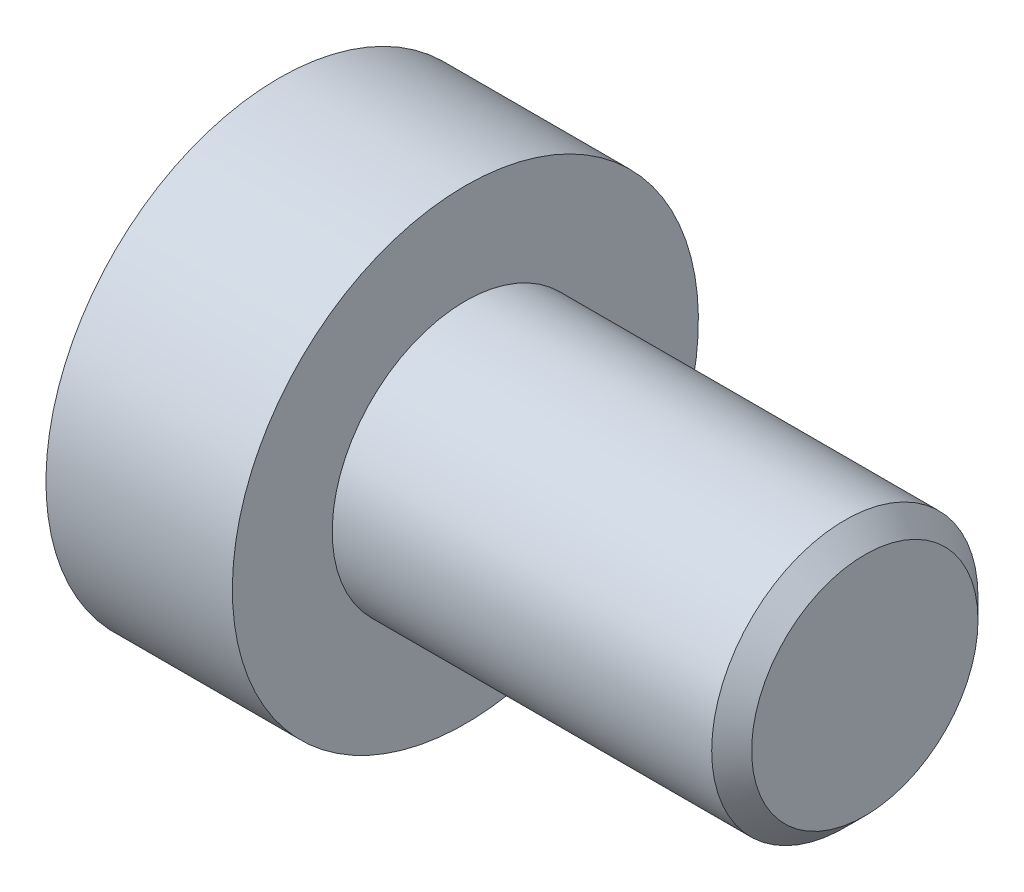
ISO-10303-21;
HEADER;
FILE_DESCRIPTION(('STEP AP214'),'2;1');
FILE_NAME('part.step','',(''),(''),'','','');
FILE_SCHEMA(('AUTOMOTIVE_DESIGN { 1 0 10303 214 1 1 1 1 }'));
ENDSEC;
DATA;
#1=APPLICATION_CONTEXT('core data for automotive mechanical design processes');
#2=APPLICATION_PROTOCOL_DEFINITION('international standard','automotive_design',2000,#1);
#3=PRODUCT_CONTEXT('',#1,'mechanical');
#4=PRODUCT('Part','Part','',(#3));
#5=PRODUCT_RELATED_PRODUCT_CATEGORY('part','',(#4));
#6=PRODUCT_DEFINITION_FORMATION('','',#4);
#7=PRODUCT_DEFINITION_CONTEXT('part definition',#1,'design');
#8=PRODUCT_DEFINITION('design','',#6,#7);
#9=PRODUCT_DEFINITION_SHAPE('','',#8);
#10=(LENGTH_UNIT() NAMED_UNIT(*) SI_UNIT(.MILLI.,.METRE.));
#11=(NAMED_UNIT(*) PLANE_ANGLE_UNIT() SI_UNIT($,.RADIAN.));
#12=(NAMED_UNIT(*) SI_UNIT($,.STERADIAN.) SOLID_ANGLE_UNIT());
#13=UNCERTAINTY_MEASURE_WITH_UNIT(LENGTH_MEASURE(1.E-05),#10,'distance_accuracy_value','');
#14=(GEOMETRIC_REPRESENTATION_CONTEXT(3) GLOBAL_UNCERTAINTY_ASSIGNED_CONTEXT((#13)) GLOBAL_UNIT_ASSIGNED_CONTEXT((#10,
#11,#12)) REPRESENTATION_CONTEXT('',''));
#15=CARTESIAN_POINT('',(0.,0.,0.));
#16=DIRECTION('',(0.,0.,1.));
#17=DIRECTION('',(1.,0.,0.));
#18=AXIS2_PLACEMENT_3D('',#15,#16,#17);
#19=CARTESIAN_POINT('',(-6.,0.,0.));
#20=DIRECTION('',(1.,0.,0.));
#21=DIRECTION('',(0.,0.,-1.));
#22=AXIS2_PLACEMENT_3D('',#19,#20,#21);
#23=CYLINDRICAL_SURFACE('',#22,2.);
#24=CARTESIAN_POINT('',(-0.300000000000003,0.,0.));
#25=DIRECTION('',(1.,0.,0.));
#26=DIRECTION('',(0.,0.,-1.));
#27=AXIS2_PLACEMENT_3D('',#24,#25,#26);
#28=CIRCLE('',#27,2.);
#29=CARTESIAN_POINT('',(-0.300000000000003,0.,-2.));
#30=VERTEX_POINT('',#29);
#31=EDGE_CURVE('E50',#30,#30,#28,.F.);
#32=ORIENTED_EDGE('',*,*,#31,.T.);
#33=EDGE_LOOP('',(#32));
#34=FACE_BOUND('',#33,.T.);
#35=CARTESIAN_POINT('',(-6.,0.,0.));
#36=DIRECTION('',(1.,0.,0.));
#37=DIRECTION('',(0.,1.,0.));
#38=AXIS2_PLACEMENT_3D('',#35,#36,#37);
#39=CIRCLE('',#38,2.);
#40=CARTESIAN_POINT('',(-6.,1.99999999999999,0.));
#41=VERTEX_POINT('',#40);
#42=EDGE_CURVE('E126',#41,#41,#39,.F.);
#43=ORIENTED_EDGE('',*,*,#42,.F.);
#44=EDGE_LOOP('',(#43));
#45=FACE_BOUND('',#44,.T.);
#46=ADVANCED_FACE('F36',(#34,#45),#23,.T.);
#47=CARTESIAN_POINT('',(0.,0.,0.));
#48=DIRECTION('',(1.,0.,0.));
#49=DIRECTION('',(0.,0.,-1.));
#50=AXIS2_PLACEMENT_3D('',#47,#48,#49);
#51=PLANE('',#50);
#52=CARTESIAN_POINT('',(0.,0.,0.));
#53=DIRECTION('',(1.,0.,0.));
#54=DIRECTION('',(0.,0.,-1.));
#55=AXIS2_PLACEMENT_3D('',#52,#53,#54);
#56=CIRCLE('',#55,1.7);
#57=CARTESIAN_POINT('',(0.,0.,-1.7));
#58=VERTEX_POINT('',#57);
#59=EDGE_CURVE('E129',#58,#58,#56,.T.);
#60=ORIENTED_EDGE('',*,*,#59,.T.);
#61=EDGE_LOOP('',(#60));
#62=FACE_BOUND('',#61,.T.);
#63=ADVANCED_FACE('F139',(#62),#51,.T.);
#64=CARTESIAN_POINT('',(0.,0.,0.));
#65=DIRECTION('',(-1.,0.,0.));
#66=DIRECTION('',(0.,0.,1.));
#67=AXIS2_PLACEMENT_3D('',#64,#65,#66);
#68=CONICAL_SURFACE('',#67,1.7,0.785398163397444);
#69=ORIENTED_EDGE('',*,*,#31,.F.);
#70=EDGE_LOOP('',(#69));
#71=FACE_BOUND('',#70,.T.);
#72=ORIENTED_EDGE('',*,*,#59,.F.);
#73=EDGE_LOOP('',(#72));
#74=FACE_BOUND('',#73,.T.);
#75=ADVANCED_FACE('F38',(#71,#74),#68,.T.);
#76=CARTESIAN_POINT('',(-8.8,0.,0.));
#77=DIRECTION('',(-1.,0.,0.));
#78=DIRECTION('',(0.,-1.,0.));
#79=AXIS2_PLACEMENT_3D('',#76,#77,#78);
#80=PLANE('',#79);
#81=CARTESIAN_POINT('',(-8.8,0.,0.));
#82=DIRECTION('',(-1.,0.,0.));
#83=DIRECTION('',(0.,-1.,0.));
#84=AXIS2_PLACEMENT_3D('',#81,#82,#83);
#85=CIRCLE('',#84,1.49337567297408);
#86=CARTESIAN_POINT('',(-8.80000000000001,-1.49337567297405,0.));
#87=VERTEX_POINT('',#86);
#88=EDGE_CURVE('E244',#87,#87,#85,.T.);
#89=ORIENTED_EDGE('',*,*,#88,.F.);
#90=EDGE_LOOP('',(#89));
#91=FACE_BOUND('',#90,.T.);
#92=CARTESIAN_POINT('',(-8.8,0.,0.));
#93=DIRECTION('',(1.,0.,0.));
#94=DIRECTION('',(0.,1.,0.));
#95=AXIS2_PLACEMENT_3D('',#92,#93,#94);
#96=CIRCLE('',#95,3.5);
#97=CARTESIAN_POINT('',(-8.8,3.5,0.));
#98=VERTEX_POINT('',#97);
#99=EDGE_CURVE('E123',#98,#98,#96,.T.);
#100=ORIENTED_EDGE('',*,*,#99,.F.);
#101=EDGE_LOOP('',(#100));
#102=FACE_BOUND('',#101,.T.);
#103=ADVANCED_FACE('F138',(#91,#102),#80,.T.);
#104=CARTESIAN_POINT('',(-6.,0.,0.));
#105=DIRECTION('',(1.,0.,0.));
#106=DIRECTION('',(0.,1.,0.));
#107=AXIS2_PLACEMENT_3D('',#104,#105,#106);
#108=CYLINDRICAL_SURFACE('',#107,3.5);
#109=ORIENTED_EDGE('',*,*,#99,.T.);
#110=EDGE_LOOP('',(#109));
#111=FACE_BOUND('',#110,.T.);
#112=CARTESIAN_POINT('',(-6.,0.,0.));
#113=DIRECTION('',(1.,0.,0.));
#114=DIRECTION('',(0.,1.,0.));
#115=AXIS2_PLACEMENT_3D('',#112,#113,#114);
#116=CIRCLE('',#115,3.5);
#117=CARTESIAN_POINT('',(-6.,3.5,0.));
#118=VERTEX_POINT('',#117);
#119=EDGE_CURVE('E120',#118,#118,#116,.T.);
#120=ORIENTED_EDGE('',*,*,#119,.F.);
#121=EDGE_LOOP('',(#120));
#122=FACE_BOUND('',#121,.T.);
#123=ADVANCED_FACE('F150',(#111,#122),#108,.T.);
#124=CARTESIAN_POINT('',(-6.,3.5,0.));
#125=DIRECTION('',(1.,0.,0.));
#126=DIRECTION('',(0.,1.,0.));
#127=AXIS2_PLACEMENT_3D('',#124,#125,#126);
#128=PLANE('',#127);
#129=ORIENTED_EDGE('',*,*,#42,.T.);
#130=EDGE_LOOP('',(#129));
#131=FACE_BOUND('',#130,.T.);
#132=ORIENTED_EDGE('',*,*,#119,.T.);
#133=EDGE_LOOP('',(#132));
#134=FACE_BOUND('',#133,.T.);
#135=ADVANCED_FACE('F154',(#131,#134),#128,.T.);
#136=CARTESIAN_POINT('',(-8.8,0.,0.));
#137=DIRECTION('',(-1.,0.,0.));
#138=DIRECTION('',(0.,-1.,0.));
#139=AXIS2_PLACEMENT_3D('',#136,#137,#138);
#140=CONICAL_SURFACE('',#139,1.49337567297408,0.78539816339745);
#141=ORIENTED_EDGE('',*,*,#88,.T.);
#142=EDGE_LOOP('',(#141));
#143=FACE_BOUND('',#142,.T.);
#144=CARTESIAN_POINT('',(-9.20140216898837,-1.42396736984798,1.25));
#145=CARTESIAN_POINT('',(-9.17529613644805,-1.38922450814775,1.25));
#146=CARTESIAN_POINT('',(-9.14945065634314,-1.35428640192996,1.25));
#147=CARTESIAN_POINT('',(-9.09838791202342,-1.28394100441963,1.25));
#148=CARTESIAN_POINT('',(-9.07317080935882,-1.24853359598577,1.25));
#149=CARTESIAN_POINT('',(-8.99826335395112,-1.1409714001612,1.25));
#150=CARTESIAN_POINT('',(-8.94971904359717,-1.0680049582675,1.25));
#151=CARTESIAN_POINT('',(-8.85456001629848,-0.915095472420351,1.25));
#152=CARTESIAN_POINT('',(-8.80820303826042,-0.834990154954495,1.25));
#153=CARTESIAN_POINT('',(-8.72350392700248,-0.670798348959412,1.25));
#154=CARTESIAN_POINT('',(-8.68513479787227,-0.58672648793716,1.25));
#155=CARTESIAN_POINT('',(-8.63819850204759,-0.460385334768697,1.25));
#156=CARTESIAN_POINT('',(-8.62470212076981,-0.419954113336603,1.25));
#157=CARTESIAN_POINT('',(-8.60095730744747,-0.338129031291281,1.25));
#158=CARTESIAN_POINT('',(-8.5907091035293,-0.296735103284174,1.25));
#159=CARTESIAN_POINT('',(-8.57415946635525,-0.213916243687788,1.25));
#160=CARTESIAN_POINT('',(-8.56779133855251,-0.172504848949336,1.25));
#161=CARTESIAN_POINT('',(-8.55912371966082,-0.0892560954741928,1.25));
#162=CARTESIAN_POINT('',(-8.55682355999816,-0.0474188078703005,1.25));
#163=CARTESIAN_POINT('',(-8.55645641051935,0.0348235296905066,1.25));
#164=CARTESIAN_POINT('',(-8.55824554854156,0.0752279922916836,1.25));
#165=CARTESIAN_POINT('',(-8.56564480351348,0.155687005579612,1.25));
#166=CARTESIAN_POINT('',(-8.57125566297007,0.195741486737967,1.25));
#167=CARTESIAN_POINT('',(-8.5860898151071,0.275882483894674,1.25));
#168=CARTESIAN_POINT('',(-8.59537388954039,0.315957579678778,1.25));
#169=CARTESIAN_POINT('',(-8.61706569649922,0.395234027395286,1.25));
#170=CARTESIAN_POINT('',(-8.62947314897842,0.434435457318926,1.25));
#171=CARTESIAN_POINT('',(-8.6734108304631,0.558570325397125,1.25));
#172=CARTESIAN_POINT('',(-8.70997441432895,0.641718054005946,1.25));
#173=CARTESIAN_POINT('',(-8.79124788730661,0.804100725662088,1.25));
#174=CARTESIAN_POINT('',(-8.83598718952972,0.883320183915878,1.25));
#175=CARTESIAN_POINT('',(-8.92826522864606,1.03470895505823,1.25));
#176=CARTESIAN_POINT('',(-8.97555343888178,1.10703287925038,1.25));
#177=CARTESIAN_POINT('',(-9.04864632092525,1.21358798649191,1.25));
#178=CARTESIAN_POINT('',(-9.07326644329957,1.24864609054882,1.25));
#179=CARTESIAN_POINT('',(-9.12315526013102,1.31828380805649,1.25));
#180=CARTESIAN_POINT('',(-9.14842377580172,1.35286354944694,1.25));
#181=CARTESIAN_POINT('',(-9.17396105811685,1.38724419886388,1.25));
#182=B_SPLINE_CURVE_WITH_KNOTS('',3,(#144,#145,#146,#147,#148,#149,#150,#151,#152,#153,#154,
#155,#156,#157,#158,#159,#160,#161,#162,#163,#164,#165,#166,#167,#168,#169,#170,#171,#172,#173,
#174,#175,#176,#177,#178,#179,#180,#181),.UNSPECIFIED.,.F.,.F.,(4,2,2,2,2,2,2,2,2,2,2,2,2,2,2,2,
2,2,4),(0.,0.130370422461748,0.260774023229279,0.523571931962181,0.800995227642792,
1.07746514553942,1.20522972687283,1.33300327939672,1.45851355132216,1.5840031936199,
1.70514602294322,1.82631239533597,1.94957373840992,2.07282403363807,2.34451838945522,
2.61721016161585,2.87631588769062,3.00482945023601,3.13330794967362),.UNSPECIFIED.);
#183=CARTESIAN_POINT('',(-8.74999999999999,-0.721687836486998,1.25));
#184=VERTEX_POINT('',#183);
#185=CARTESIAN_POINT('',(-8.74999999999998,0.721687836487067,1.25));
#186=VERTEX_POINT('',#185);
#187=EDGE_CURVE('E104',#184,#186,#182,.T.);
#188=ORIENTED_EDGE('',*,*,#187,.F.);
#189=CARTESIAN_POINT('',(-8.75011548390912,-1.44349114302787,-0.000200000000000523));
#190=CARTESIAN_POINT('',(-8.72532166805509,-1.41867941875062,0.0427751670715866));
#191=CARTESIAN_POINT('',(-8.70198373441867,-1.3934527698074,0.086469004745948));
#192=CARTESIAN_POINT('',(-8.65925200408452,-1.34201263554191,0.175565930841942));
#193=CARTESIAN_POINT('',(-8.6398819923604,-1.31579425481273,0.220977498357063));
#194=CARTESIAN_POINT('',(-8.60670048341346,-1.26292610442243,0.312547820935259));
#195=CARTESIAN_POINT('',(-8.59280555905264,-1.23628980770468,0.358683240175885));
#196=CARTESIAN_POINT('',(-8.57139728216062,-1.18243062538505,0.451970080407591));
#197=CARTESIAN_POINT('',(-8.56386794156677,-1.15520938653758,0.499118649136379));
#198=CARTESIAN_POINT('',(-8.55707449805069,-1.10829684367464,0.580373556887251));
#199=CARTESIAN_POINT('',(-8.55606855910434,-1.08866617256955,0.61437487662794));
#200=CARTESIAN_POINT('',(-8.55776141491131,-1.04943932800608,0.682317764432476));
#201=CARTESIAN_POINT('',(-8.56046102721552,-1.02984316311596,0.716259317655657));
#202=CARTESIAN_POINT('',(-8.56940893031636,-0.990839954603466,0.783814856457499));
#203=CARTESIAN_POINT('',(-8.57566052589969,-0.971433104248738,0.817428507286774));
#204=CARTESIAN_POINT('',(-8.59137568141389,-0.932943395609872,0.884094638217812));
#205=CARTESIAN_POINT('',(-8.60084062008744,-0.913860680098267,0.917146871030295));
#206=CARTESIAN_POINT('',(-8.62893139068757,-0.864986351354534,1.00179969160026));
#207=CARTESIAN_POINT('',(-8.64967015745219,-0.835502920149042,1.05286649242964));
#208=CARTESIAN_POINT('',(-8.69638713467146,-0.777690319475875,1.15300085411325));
#209=CARTESIAN_POINT('',(-8.72234829594675,-0.749357745598383,1.20207431157827));
#210=CARTESIAN_POINT('',(-8.75011548390912,-0.72157236643316,1.2502));
#211=B_SPLINE_CURVE_WITH_KNOTS('',3,(#189,#190,#191,#192,#193,#194,#195,#196,#197,#198,#199,
#200,#201,#202,#203,#204,#205,#206,#207,#208,#209,#210),.UNSPECIFIED.,.F.,.F.,(4,2,2,2,2,2,2,2,
2,2,4),(0.,0.166533409618304,0.334037607289761,0.498880396489698,0.663307919240274,
0.780963963458826,0.898645970148452,1.01643764860773,1.13427993171549,1.32148652032141,
1.50809158792573),.UNSPECIFIED.);
#212=CARTESIAN_POINT('',(-8.74999999999999,-1.44337567297403,0.));
#213=VERTEX_POINT('',#212);
#214=EDGE_CURVE('E200',#213,#184,#211,.T.);
#215=ORIENTED_EDGE('',*,*,#214,.F.);
#216=CARTESIAN_POINT('',(-8.75011548390912,-0.72157236643316,-1.2502));
#217=CARTESIAN_POINT('',(-8.72532166805509,-0.74638409071041,-1.20722483292841));
#218=CARTESIAN_POINT('',(-8.70198373441867,-0.77161073965363,-1.16353099525405));
#219=CARTESIAN_POINT('',(-8.65925200408452,-0.82305087391912,-1.07443406915806));
#220=CARTESIAN_POINT('',(-8.6398819923604,-0.849269254648299,-1.02902250164294));
#221=CARTESIAN_POINT('',(-8.60670048341346,-0.902137405038601,-0.937452179064741));
#222=CARTESIAN_POINT('',(-8.59280555905264,-0.928773701756353,-0.891316759824115));
#223=CARTESIAN_POINT('',(-8.57139728216062,-0.982632884075978,-0.798029919592408));
#224=CARTESIAN_POINT('',(-8.56386794156677,-1.00985412292345,-0.750881350863621));
#225=CARTESIAN_POINT('',(-8.55707449805069,-1.05676666578639,-0.669626443112748));
#226=CARTESIAN_POINT('',(-8.55606855910434,-1.07639733689148,-0.63562512337206));
#227=CARTESIAN_POINT('',(-8.55776141491131,-1.11562418145495,-0.567682235567523));
#228=CARTESIAN_POINT('',(-8.56046102721552,-1.13522034634507,-0.533740682344343));
#229=CARTESIAN_POINT('',(-8.56940893031636,-1.17422355485756,-0.466185143542501));
#230=CARTESIAN_POINT('',(-8.57566052589969,-1.19363040521229,-0.432571492713226));
#231=CARTESIAN_POINT('',(-8.59137568141389,-1.23212011385116,-0.365905361782188));
#232=CARTESIAN_POINT('',(-8.60084062008744,-1.25120282936276,-0.332853128969705));
#233=CARTESIAN_POINT('',(-8.62893139068757,-1.30007715810649,-0.248200308399737));
#234=CARTESIAN_POINT('',(-8.64967015745219,-1.32956058931199,-0.197133507570363));
#235=CARTESIAN_POINT('',(-8.69638713467146,-1.38737318998515,-0.0969991458867464));
#236=CARTESIAN_POINT('',(-8.72234829594676,-1.41570576386264,-0.0479256884217317));
#237=CARTESIAN_POINT('',(-8.75011548390912,-1.44349114302787,0.000199999999999044));
#238=B_SPLINE_CURVE_WITH_KNOTS('',3,(#216,#217,#218,#219,#220,#221,#222,#223,#224,#225,#226,
#227,#228,#229,#230,#231,#232,#233,#234,#235,#236,#237),.UNSPECIFIED.,.F.,.F.,(4,2,2,2,2,2,2,2,
2,2,4),(0.,0.166533409618303,0.334037607289761,0.498880396489697,0.663307919240273,
0.780963963458825,0.898645970148451,1.01643764860773,1.13427993171549,1.32148652032141,
1.50809158792573),.UNSPECIFIED.);
#239=CARTESIAN_POINT('',(-8.74999999999999,-0.721687836486998,-1.25));
#240=VERTEX_POINT('',#239);
#241=EDGE_CURVE('E194',#240,#213,#238,.T.);
#242=ORIENTED_EDGE('',*,*,#241,.F.);
#243=CARTESIAN_POINT('',(-9.20140216898837,-1.42396736984798,-1.25));
#244=CARTESIAN_POINT('',(-9.17529613644804,-1.38922450814774,-1.25));
#245=CARTESIAN_POINT('',(-9.14945065634314,-1.35428640192996,-1.25));
#246=CARTESIAN_POINT('',(-9.09838791202342,-1.28394100441962,-1.25));
#247=CARTESIAN_POINT('',(-9.07317080935881,-1.24853359598576,-1.25));
#248=CARTESIAN_POINT('',(-8.99826335395112,-1.14097140016119,-1.25));
#249=CARTESIAN_POINT('',(-8.94971904359717,-1.0680049582675,-1.25));
#250=CARTESIAN_POINT('',(-8.85456001629848,-0.91509547242035,-1.25));
#251=CARTESIAN_POINT('',(-8.80820303826042,-0.834990154954493,-1.25));
#252=CARTESIAN_POINT('',(-8.72350392700248,-0.670798348959409,-1.25));
#253=CARTESIAN_POINT('',(-8.68513479787227,-0.586726487937158,-1.25));
#254=CARTESIAN_POINT('',(-8.63819850204759,-0.460385334768696,-1.25));
#255=CARTESIAN_POINT('',(-8.62470212076981,-0.419954113336601,-1.25));
#256=CARTESIAN_POINT('',(-8.60095730744747,-0.33812903129128,-1.25));
#257=CARTESIAN_POINT('',(-8.5907091035293,-0.296735103284173,-1.25));
#258=CARTESIAN_POINT('',(-8.57415946635525,-0.213916243687787,-1.25));
#259=CARTESIAN_POINT('',(-8.56779133855251,-0.172504848949335,-1.25));
#260=CARTESIAN_POINT('',(-8.55912371966082,-0.0892560954741923,-1.25));
#261=CARTESIAN_POINT('',(-8.55682355999816,-0.0474188078703002,-1.25));
#262=CARTESIAN_POINT('',(-8.55645641051935,0.0348235296905068,-1.25));
#263=CARTESIAN_POINT('',(-8.55824554854156,0.0752279922916837,-1.25));
#264=CARTESIAN_POINT('',(-8.56564480351348,0.155687005579612,-1.25));
#265=CARTESIAN_POINT('',(-8.57125566297007,0.195741486737967,-1.25));
#266=CARTESIAN_POINT('',(-8.5860898151071,0.275882483894674,-1.25));
#267=CARTESIAN_POINT('',(-8.59537388954039,0.315957579678778,-1.25));
#268=CARTESIAN_POINT('',(-8.61706569649922,0.395234027395286,-1.25));
#269=CARTESIAN_POINT('',(-8.62947314897842,0.434435457318926,-1.25));
#270=CARTESIAN_POINT('',(-8.6734108304631,0.558570325397125,-1.25));
#271=CARTESIAN_POINT('',(-8.70997441432895,0.641718054005946,-1.25));
#272=CARTESIAN_POINT('',(-8.79124788730661,0.804100725662087,-1.25));
#273=CARTESIAN_POINT('',(-8.83598718952972,0.883320183915878,-1.25));
#274=CARTESIAN_POINT('',(-8.92826522864606,1.03470895505823,-1.25));
#275=CARTESIAN_POINT('',(-8.97555343888178,1.10703287925038,-1.25));
#276=CARTESIAN_POINT('',(-9.04864632092525,1.21358798649191,-1.25));
#277=CARTESIAN_POINT('',(-9.07326644329957,1.24864609054882,-1.25));
#278=CARTESIAN_POINT('',(-9.12315526013102,1.31828380805649,-1.25));
#279=CARTESIAN_POINT('',(-9.14842377580172,1.35286354944694,-1.25));
#280=CARTESIAN_POINT('',(-9.17396105811685,1.38724419886388,-1.25));
#281=B_SPLINE_CURVE_WITH_KNOTS('',3,(#243,#244,#245,#246,#247,#248,#249,#250,#251,#252,#253,
#254,#255,#256,#257,#258,#259,#260,#261,#262,#263,#264,#265,#266,#267,#268,#269,#270,#271,#272,
#273,#274,#275,#276,#277,#278,#279,#280),.UNSPECIFIED.,.F.,.F.,(4,2,2,2,2,2,2,2,2,2,2,2,2,2,2,2,
2,2,4),(0.,0.130370422461749,0.26077402322928,0.523571931962181,0.800995227642793,
1.07746514553942,1.20522972687283,1.33300327939672,1.45851355132216,1.5840031936199,
1.70514602294322,1.82631239533597,1.94957373840992,2.07282403363807,2.34451838945522,
2.61721016161585,2.87631588769062,3.004829450236,3.13330794967362),.UNSPECIFIED.);
#282=CARTESIAN_POINT('',(-8.74999999999998,0.721687836487067,-1.25));
#283=VERTEX_POINT('',#282);
#284=EDGE_CURVE('E57',#283,#240,#281,.F.);
#285=ORIENTED_EDGE('',*,*,#284,.F.);
#286=CARTESIAN_POINT('',(-8.75011548390911,1.44349114302794,0.000200000000000746));
#287=CARTESIAN_POINT('',(-8.72532166805508,1.41867941875069,-0.0427751670715857));
#288=CARTESIAN_POINT('',(-8.70198373441866,1.39345276980747,-0.0864690047459471));
#289=CARTESIAN_POINT('',(-8.65925200408451,1.34201263554198,-0.175565930841941));
#290=CARTESIAN_POINT('',(-8.63988199236039,1.3157942548128,-0.220977498357063));
#291=CARTESIAN_POINT('',(-8.60670048341346,1.26292610442249,-0.312547820935259));
#292=CARTESIAN_POINT('',(-8.59280555905263,1.23628980770474,-0.358683240175885));
#293=CARTESIAN_POINT('',(-8.57139728216062,1.18243062538512,-0.451970080407592));
#294=CARTESIAN_POINT('',(-8.56386794156676,1.15520938653765,-0.499118649136379));
#295=CARTESIAN_POINT('',(-8.55707449805068,1.1082968436747,-0.580373556887252));
#296=CARTESIAN_POINT('',(-8.55606855910433,1.08866617256961,-0.61437487662794));
#297=CARTESIAN_POINT('',(-8.5577614149113,1.04943932800614,-0.682317764432477));
#298=CARTESIAN_POINT('',(-8.56046102721552,1.02984316311603,-0.716259317655657));
#299=CARTESIAN_POINT('',(-8.56940893031636,0.990839954603533,-0.783814856457499));
#300=CARTESIAN_POINT('',(-8.57566052589968,0.971433104248805,-0.817428507286774));
#301=CARTESIAN_POINT('',(-8.59137568141388,0.932943395609939,-0.884094638217812));
#302=CARTESIAN_POINT('',(-8.60084062008744,0.913860680098334,-0.917146871030295));
#303=CARTESIAN_POINT('',(-8.62893139068757,0.864986351354602,-1.00179969160026));
#304=CARTESIAN_POINT('',(-8.64967015745218,0.83550292014911,-1.05286649242964));
#305=CARTESIAN_POINT('',(-8.69638713467145,0.777690319475943,-1.15300085411325));
#306=CARTESIAN_POINT('',(-8.72234829594674,0.749357745598451,-1.20207431157827));
#307=CARTESIAN_POINT('',(-8.75011548390911,0.721572366433229,-1.2502));
#308=B_SPLINE_CURVE_WITH_KNOTS('',3,(#286,#287,#288,#289,#290,#291,#292,#293,#294,#295,#296,
#297,#298,#299,#300,#301,#302,#303,#304,#305,#306,#307),.UNSPECIFIED.,.F.,.F.,(4,2,2,2,2,2,2,2,
2,2,4),(0.,0.166533409618304,0.334037607289762,0.498880396489699,0.663307919240275,
0.780963963458827,0.898645970148453,1.01643764860773,1.1342799317155,1.32148652032141,
1.50809158792574),.UNSPECIFIED.);
#309=CARTESIAN_POINT('',(-8.74999999999998,1.4433756729741,0.));
#310=VERTEX_POINT('',#309);
#311=EDGE_CURVE('E11',#310,#283,#308,.T.);
#312=ORIENTED_EDGE('',*,*,#311,.F.);
#313=CARTESIAN_POINT('',(-8.75011548390911,0.721572366433229,1.2502));
#314=CARTESIAN_POINT('',(-8.72532166805508,0.746384090710478,1.20722483292841));
#315=CARTESIAN_POINT('',(-8.70198373441866,0.771610739653699,1.16353099525405));
#316=CARTESIAN_POINT('',(-8.65925200408452,0.823050873919189,1.07443406915806));
#317=CARTESIAN_POINT('',(-8.63988199236039,0.849269254648367,1.02902250164294));
#318=CARTESIAN_POINT('',(-8.60670048341346,0.902137405038669,0.93745217906474));
#319=CARTESIAN_POINT('',(-8.59280555905263,0.92877370175642,0.891316759824115));
#320=CARTESIAN_POINT('',(-8.57139728216062,0.982632884076045,0.798029919592408));
#321=CARTESIAN_POINT('',(-8.56386794156676,1.00985412292352,0.750881350863621));
#322=CARTESIAN_POINT('',(-8.55707449805068,1.05676666578646,0.669626443112749));
#323=CARTESIAN_POINT('',(-8.55606855910433,1.07639733689155,0.63562512337206));
#324=CARTESIAN_POINT('',(-8.5577614149113,1.11562418145502,0.567682235567524));
#325=CARTESIAN_POINT('',(-8.56046102721552,1.13522034634514,0.533740682344343));
#326=CARTESIAN_POINT('',(-8.56940893031635,1.17422355485763,0.466185143542501));
#327=CARTESIAN_POINT('',(-8.57566052589968,1.19363040521236,0.432571492713226));
#328=CARTESIAN_POINT('',(-8.59137568141388,1.23212011385122,0.365905361782188));
#329=CARTESIAN_POINT('',(-8.60084062008744,1.25120282936283,0.332853128969706));
#330=CARTESIAN_POINT('',(-8.62893139068756,1.30007715810656,0.248200308399737));
#331=CARTESIAN_POINT('',(-8.64967015745218,1.32956058931205,0.197133507570363));
#332=CARTESIAN_POINT('',(-8.69638713467145,1.38737318998522,0.0969991458867466));
#333=CARTESIAN_POINT('',(-8.72234829594674,1.41570576386271,0.0479256884217319));
#334=CARTESIAN_POINT('',(-8.75011548390911,1.44349114302794,-0.000199999999998879));
#335=B_SPLINE_CURVE_WITH_KNOTS('',3,(#313,#314,#315,#316,#317,#318,#319,#320,#321,#322,#323,
#324,#325,#326,#327,#328,#329,#330,#331,#332,#333,#334),.UNSPECIFIED.,.F.,.F.,(4,2,2,2,2,2,2,2,
2,2,4),(0.,0.166533409618303,0.334037607289761,0.498880396489696,0.663307919240272,
0.780963963458825,0.898645970148451,1.01643764860773,1.13427993171549,1.32148652032141,
1.50809158792573),.UNSPECIFIED.);
#336=EDGE_CURVE('E95',#186,#310,#335,.T.);
#337=ORIENTED_EDGE('',*,*,#336,.F.);
#338=EDGE_LOOP('',(#188,#215,#242,#285,#312,#337));
#339=FACE_BOUND('',#338,.T.);
#340=ADVANCED_FACE('F94',(#143,#339),#140,.F.);
#341=CARTESIAN_POINT('',(-7.2,0.,0.));
#342=DIRECTION('',(-1.,0.,0.));
#343=DIRECTION('',(0.,-1.,0.));
#344=AXIS2_PLACEMENT_3D('',#341,#342,#343);
#345=PLANE('',#344);
#346=DIRECTION('',(0.,0.5,-0.866025403784439));
#347=VECTOR('',#346,1.);
#348=CARTESIAN_POINT('',(-7.2,0.721687836487061,1.25));
#349=LINE('',#348,#347);
#350=CARTESIAN_POINT('',(-7.2,0.721687836487061,1.25));
#351=VERTEX_POINT('',#350);
#352=CARTESIAN_POINT('',(-7.2,1.44337567297409,0.));
#353=VERTEX_POINT('',#352);
#354=EDGE_CURVE('E103',#351,#353,#349,.T.);
#355=ORIENTED_EDGE('',*,*,#354,.T.);
#356=DIRECTION('',(0.,-0.5,-0.866025403784439));
#357=VECTOR('',#356,1.);
#358=CARTESIAN_POINT('',(-7.2,1.44337567297409,0.));
#359=LINE('',#358,#357);
#360=CARTESIAN_POINT('',(-7.2,0.721687836487061,-1.25));
#361=VERTEX_POINT('',#360);
#362=EDGE_CURVE('E108',#353,#361,#359,.T.);
#363=ORIENTED_EDGE('',*,*,#362,.T.);
#364=DIRECTION('',(0.,-1.,0.));
#365=VECTOR('',#364,1.);
#366=CARTESIAN_POINT('',(-7.2,0.721687836487061,-1.25));
#367=LINE('',#366,#365);
#368=CARTESIAN_POINT('',(-7.2,-0.721687836487003,-1.25));
#369=VERTEX_POINT('',#368);
#370=EDGE_CURVE('E226',#361,#369,#367,.T.);
#371=ORIENTED_EDGE('',*,*,#370,.T.);
#372=DIRECTION('',(0.,-0.5,0.866025403784439));
#373=VECTOR('',#372,1.);
#374=CARTESIAN_POINT('',(-7.2,-0.721687836487003,-1.25));
#375=LINE('',#374,#373);
#376=CARTESIAN_POINT('',(-7.20000000000001,-1.44337567297404,0.));
#377=VERTEX_POINT('',#376);
#378=EDGE_CURVE('E230',#369,#377,#375,.T.);
#379=ORIENTED_EDGE('',*,*,#378,.T.);
#380=DIRECTION('',(0.,0.5,0.866025403784439));
#381=VECTOR('',#380,1.);
#382=CARTESIAN_POINT('',(-7.20000000000001,-1.44337567297404,0.));
#383=LINE('',#382,#381);
#384=CARTESIAN_POINT('',(-7.2,-0.721687836487004,1.25));
#385=VERTEX_POINT('',#384);
#386=EDGE_CURVE('E116',#377,#385,#383,.T.);
#387=ORIENTED_EDGE('',*,*,#386,.T.);
#388=DIRECTION('',(0.,1.,0.));
#389=VECTOR('',#388,1.);
#390=CARTESIAN_POINT('',(-7.2,-0.721687836487004,1.25));
#391=LINE('',#390,#389);
#392=EDGE_CURVE('E111',#385,#351,#391,.T.);
#393=ORIENTED_EDGE('',*,*,#392,.T.);
#394=EDGE_LOOP('',(#355,#363,#371,#379,#387,#393));
#395=FACE_BOUND('',#394,.T.);
#396=ADVANCED_FACE('F180',(#395),#345,.T.);
#397=CARTESIAN_POINT('',(-7.2,1.44337567297409,0.));
#398=DIRECTION('',(0.,0.866025403784439,-0.5));
#399=DIRECTION('',(0.,0.5,0.866025403784439));
#400=AXIS2_PLACEMENT_3D('',#397,#398,#399);
#401=PLANE('',#400);
#402=DIRECTION('',(-1.,0.,0.));
#403=VECTOR('',#402,1.);
#404=CARTESIAN_POINT('',(-7.2,1.44337567297409,0.));
#405=LINE('',#404,#403);
#406=EDGE_CURVE('E101',#353,#310,#405,.T.);
#407=ORIENTED_EDGE('',*,*,#406,.T.);
#408=ORIENTED_EDGE('',*,*,#311,.T.);
#409=DIRECTION('',(-1.,0.,0.));
#410=VECTOR('',#409,1.);
#411=CARTESIAN_POINT('',(-7.2,0.721687836487061,-1.25));
#412=LINE('',#411,#410);
#413=EDGE_CURVE('E110',#361,#283,#412,.T.);
#414=ORIENTED_EDGE('',*,*,#413,.F.);
#415=ORIENTED_EDGE('',*,*,#362,.F.);
#416=EDGE_LOOP('',(#407,#408,#414,#415));
#417=FACE_BOUND('',#416,.T.);
#418=ADVANCED_FACE('F106',(#417),#401,.F.);
#419=CARTESIAN_POINT('',(-7.2,0.721687836487061,-1.25));
#420=DIRECTION('',(0.,0.,-1.));
#421=DIRECTION('',(-1.,0.,0.));
#422=AXIS2_PLACEMENT_3D('',#419,#420,#421);
#423=PLANE('',#422);
#424=ORIENTED_EDGE('',*,*,#413,.T.);
#425=ORIENTED_EDGE('',*,*,#284,.T.);
#426=DIRECTION('',(-1.,0.,0.));
#427=VECTOR('',#426,1.);
#428=CARTESIAN_POINT('',(-7.2,-0.721687836487003,-1.25));
#429=LINE('',#428,#427);
#430=EDGE_CURVE('E113',#369,#240,#429,.T.);
#431=ORIENTED_EDGE('',*,*,#430,.F.);
#432=ORIENTED_EDGE('',*,*,#370,.F.);
#433=EDGE_LOOP('',(#424,#425,#431,#432));
#434=FACE_BOUND('',#433,.T.);
#435=ADVANCED_FACE('F215',(#434),#423,.F.);
#436=CARTESIAN_POINT('',(-7.2,-0.721687836487003,-1.25));
#437=DIRECTION('',(0.,-0.866025403784439,-0.5));
#438=DIRECTION('',(0.,0.5,-0.866025403784439));
#439=AXIS2_PLACEMENT_3D('',#436,#437,#438);
#440=PLANE('',#439);
#441=ORIENTED_EDGE('',*,*,#430,.T.);
#442=ORIENTED_EDGE('',*,*,#241,.T.);
#443=DIRECTION('',(-1.,0.,0.));
#444=VECTOR('',#443,1.);
#445=CARTESIAN_POINT('',(-7.20000000000001,-1.44337567297404,0.));
#446=LINE('',#445,#444);
#447=EDGE_CURVE('E240',#377,#213,#446,.T.);
#448=ORIENTED_EDGE('',*,*,#447,.F.);
#449=ORIENTED_EDGE('',*,*,#378,.F.);
#450=EDGE_LOOP('',(#441,#442,#448,#449));
#451=FACE_BOUND('',#450,.T.);
#452=ADVANCED_FACE('F210',(#451),#440,.F.);
#453=CARTESIAN_POINT('',(-7.20000000000001,-1.44337567297404,0.));
#454=DIRECTION('',(0.,-0.866025403784439,0.5));
#455=DIRECTION('',(0.,-0.5,-0.866025403784439));
#456=AXIS2_PLACEMENT_3D('',#453,#454,#455);
#457=PLANE('',#456);
#458=ORIENTED_EDGE('',*,*,#447,.T.);
#459=ORIENTED_EDGE('',*,*,#214,.T.);
#460=DIRECTION('',(-1.,0.,0.));
#461=VECTOR('',#460,1.);
#462=CARTESIAN_POINT('',(-7.2,-0.721687836487004,1.25));
#463=LINE('',#462,#461);
#464=EDGE_CURVE('E237',#385,#184,#463,.T.);
#465=ORIENTED_EDGE('',*,*,#464,.F.);
#466=ORIENTED_EDGE('',*,*,#386,.F.);
#467=EDGE_LOOP('',(#458,#459,#465,#466));
#468=FACE_BOUND('',#467,.T.);
#469=ADVANCED_FACE('F207',(#468),#457,.F.);
#470=CARTESIAN_POINT('',(-7.2,-0.721687836487004,1.25));
#471=DIRECTION('',(0.,0.,1.));
#472=DIRECTION('',(1.,0.,0.));
#473=AXIS2_PLACEMENT_3D('',#470,#471,#472);
#474=PLANE('',#473);
#475=ORIENTED_EDGE('',*,*,#464,.T.);
#476=ORIENTED_EDGE('',*,*,#187,.T.);
#477=DIRECTION('',(-1.,0.,0.));
#478=VECTOR('',#477,1.);
#479=CARTESIAN_POINT('',(-7.2,0.721687836487061,1.25));
#480=LINE('',#479,#478);
#481=EDGE_CURVE('E64',#351,#186,#480,.T.);
#482=ORIENTED_EDGE('',*,*,#481,.F.);
#483=ORIENTED_EDGE('',*,*,#392,.F.);
#484=EDGE_LOOP('',(#475,#476,#482,#483));
#485=FACE_BOUND('',#484,.T.);
#486=ADVANCED_FACE('F161',(#485),#474,.F.);
#487=CARTESIAN_POINT('',(-7.2,0.721687836487061,1.25));
#488=DIRECTION('',(0.,0.866025403784439,0.5));
#489=DIRECTION('',(0.,-0.5,0.866025403784439));
#490=AXIS2_PLACEMENT_3D('',#487,#488,#489);
#491=PLANE('',#490);
#492=ORIENTED_EDGE('',*,*,#481,.T.);
#493=ORIENTED_EDGE('',*,*,#336,.T.);
#494=ORIENTED_EDGE('',*,*,#406,.F.);
#495=ORIENTED_EDGE('',*,*,#354,.F.);
#496=EDGE_LOOP('',(#492,#493,#494,#495));
#497=FACE_BOUND('',#496,.T.);
#498=ADVANCED_FACE('F100',(#497),#491,.F.);
#499=CLOSED_SHELL('',(#46,#63,#75,#103,#123,#135,#340,#396,#418,#435,#452,#469,#486,#498));
#500=MANIFOLD_SOLID_BREP('B2',#499);
#501=ADVANCED_BREP_SHAPE_REPRESENTATION('',(#18,#500),#14);
#502=SHAPE_DEFINITION_REPRESENTATION(#9,#501);
ENDSEC;
END-ISO-10303-21;
